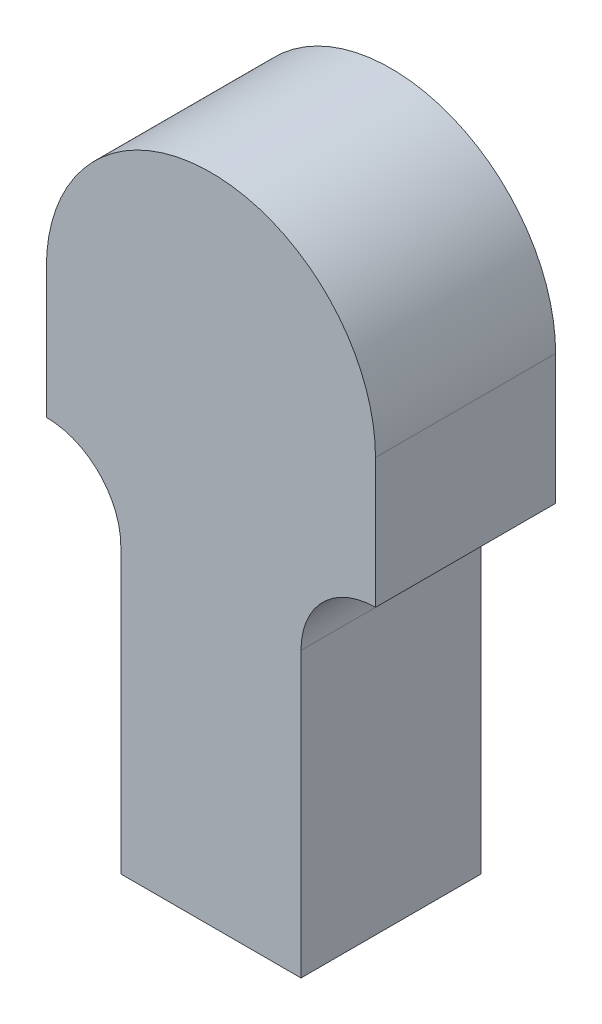
ISO-10303-21;
HEADER;
FILE_DESCRIPTION(('STEP AP214'),'2;1');
FILE_NAME('part.step','',(''),(''),'','','');
FILE_SCHEMA(('AUTOMOTIVE_DESIGN { 1 0 10303 214 1 1 1 1 }'));
ENDSEC;
DATA;
#1=APPLICATION_CONTEXT('core data for automotive mechanical design processes');
#2=APPLICATION_PROTOCOL_DEFINITION('international standard','automotive_design',2000,#1);
#3=PRODUCT_CONTEXT('',#1,'mechanical');
#4=PRODUCT('Part','Part','',(#3));
#5=PRODUCT_RELATED_PRODUCT_CATEGORY('part','',(#4));
#6=PRODUCT_DEFINITION_FORMATION('','',#4);
#7=PRODUCT_DEFINITION_CONTEXT('part definition',#1,'design');
#8=PRODUCT_DEFINITION('design','',#6,#7);
#9=PRODUCT_DEFINITION_SHAPE('','',#8);
#10=(LENGTH_UNIT() NAMED_UNIT(*) SI_UNIT(.MILLI.,.METRE.));
#11=(NAMED_UNIT(*) PLANE_ANGLE_UNIT() SI_UNIT($,.RADIAN.));
#12=(NAMED_UNIT(*) SI_UNIT($,.STERADIAN.) SOLID_ANGLE_UNIT());
#13=UNCERTAINTY_MEASURE_WITH_UNIT(LENGTH_MEASURE(1.E-05),#10,'distance_accuracy_value','');
#14=(GEOMETRIC_REPRESENTATION_CONTEXT(3) GLOBAL_UNCERTAINTY_ASSIGNED_CONTEXT((#13)) GLOBAL_UNIT_ASSIGNED_CONTEXT((#10,
#11,#12)) REPRESENTATION_CONTEXT('',''));
#15=CARTESIAN_POINT('',(0.,0.,0.));
#16=DIRECTION('',(0.,0.,1.));
#17=DIRECTION('',(1.,0.,0.));
#18=AXIS2_PLACEMENT_3D('',#15,#16,#17);
#19=CARTESIAN_POINT('',(7.9375,-18.,15.875));
#20=DIRECTION('',(-1.,0.,0.));
#21=DIRECTION('',(0.,-1.,0.));
#22=AXIS2_PLACEMENT_3D('',#19,#20,#21);
#23=PLANE('',#22);
#24=DIRECTION('',(0.,1.,0.));
#25=VECTOR('',#24,1.);
#26=CARTESIAN_POINT('',(7.9375,-18.,0.));
#27=LINE('',#26,#25);
#28=CARTESIAN_POINT('',(7.9375,-43.,0.));
#29=VERTEX_POINT('',#28);
#30=CARTESIAN_POINT('',(7.9375,-18.,0.));
#31=VERTEX_POINT('',#30);
#32=EDGE_CURVE('E131',#29,#31,#27,.T.);
#33=ORIENTED_EDGE('',*,*,#32,.T.);
#34=DIRECTION('',(0.,0.,-1.));
#35=VECTOR('',#34,1.);
#36=CARTESIAN_POINT('',(7.9375,-18.,15.875));
#37=LINE('',#36,#35);
#38=CARTESIAN_POINT('',(7.9375,-18.,15.875));
#39=VERTEX_POINT('',#38);
#40=EDGE_CURVE('E11',#39,#31,#37,.T.);
#41=ORIENTED_EDGE('',*,*,#40,.F.);
#42=DIRECTION('',(0.,1.,0.));
#43=VECTOR('',#42,1.);
#44=CARTESIAN_POINT('',(7.9375,-18.,15.875));
#45=LINE('',#44,#43);
#46=CARTESIAN_POINT('',(7.9375,-43.,15.875));
#47=VERTEX_POINT('',#46);
#48=EDGE_CURVE('E145',#47,#39,#45,.T.);
#49=ORIENTED_EDGE('',*,*,#48,.F.);
#50=DIRECTION('',(0.,0.,-1.));
#51=VECTOR('',#50,1.);
#52=CARTESIAN_POINT('',(7.9375,-43.,15.875));
#53=LINE('',#52,#51);
#54=EDGE_CURVE('E127',#47,#29,#53,.T.);
#55=ORIENTED_EDGE('',*,*,#54,.T.);
#56=EDGE_LOOP('',(#33,#41,#49,#55));
#57=FACE_BOUND('',#56,.T.);
#58=ADVANCED_FACE('F35',(#57),#23,.F.);
#59=CARTESIAN_POINT('',(14.5,-18.,15.875));
#60=DIRECTION('',(0.,0.,-1.));
#61=DIRECTION('',(-1.,0.,0.));
#62=AXIS2_PLACEMENT_3D('',#59,#60,#61);
#63=CYLINDRICAL_SURFACE('',#62,6.5625);
#64=CARTESIAN_POINT('',(14.5,-18.,0.));
#65=DIRECTION('',(0.,0.,-1.));
#66=DIRECTION('',(1.,0.,0.));
#67=AXIS2_PLACEMENT_3D('',#64,#65,#66);
#68=CIRCLE('',#67,6.5625);
#69=CARTESIAN_POINT('',(14.5,-11.4375,0.));
#70=VERTEX_POINT('',#69);
#71=EDGE_CURVE('E134',#31,#70,#68,.T.);
#72=ORIENTED_EDGE('',*,*,#71,.T.);
#73=DIRECTION('',(0.,0.,-1.));
#74=VECTOR('',#73,1.);
#75=CARTESIAN_POINT('',(14.5,-11.4375,15.875));
#76=LINE('',#75,#74);
#77=CARTESIAN_POINT('',(14.5,-11.4375,15.875));
#78=VERTEX_POINT('',#77);
#79=EDGE_CURVE('E43',#78,#70,#76,.T.);
#80=ORIENTED_EDGE('',*,*,#79,.F.);
#81=CARTESIAN_POINT('',(14.5,-18.,15.875));
#82=DIRECTION('',(0.,0.,-1.));
#83=DIRECTION('',(1.,0.,0.));
#84=AXIS2_PLACEMENT_3D('',#81,#82,#83);
#85=CIRCLE('',#84,6.5625);
#86=EDGE_CURVE('E94',#39,#78,#85,.T.);
#87=ORIENTED_EDGE('',*,*,#86,.F.);
#88=ORIENTED_EDGE('',*,*,#40,.T.);
#89=EDGE_LOOP('',(#72,#80,#87,#88));
#90=FACE_BOUND('',#89,.T.);
#91=ADVANCED_FACE('F180',(#90),#63,.F.);
#92=CARTESIAN_POINT('',(14.5,0.,15.875));
#93=DIRECTION('',(-1.,0.,0.));
#94=DIRECTION('',(0.,0.,1.));
#95=AXIS2_PLACEMENT_3D('',#92,#93,#94);
#96=PLANE('',#95);
#97=DIRECTION('',(0.,1.,0.));
#98=VECTOR('',#97,1.);
#99=CARTESIAN_POINT('',(14.5,0.,0.));
#100=LINE('',#99,#98);
#101=CARTESIAN_POINT('',(14.5,0.,0.));
#102=VERTEX_POINT('',#101);
#103=EDGE_CURVE('E136',#70,#102,#100,.T.);
#104=ORIENTED_EDGE('',*,*,#103,.T.);
#105=DIRECTION('',(0.,0.,-1.));
#106=VECTOR('',#105,1.);
#107=CARTESIAN_POINT('',(14.5,0.,15.875));
#108=LINE('',#107,#106);
#109=CARTESIAN_POINT('',(14.5,0.,15.875));
#110=VERTEX_POINT('',#109);
#111=EDGE_CURVE('E152',#110,#102,#108,.T.);
#112=ORIENTED_EDGE('',*,*,#111,.F.);
#113=DIRECTION('',(0.,1.,0.));
#114=VECTOR('',#113,1.);
#115=CARTESIAN_POINT('',(14.5,0.,15.875));
#116=LINE('',#115,#114);
#117=EDGE_CURVE('E160',#78,#110,#116,.T.);
#118=ORIENTED_EDGE('',*,*,#117,.F.);
#119=ORIENTED_EDGE('',*,*,#79,.T.);
#120=EDGE_LOOP('',(#104,#112,#118,#119));
#121=FACE_BOUND('',#120,.T.);
#122=ADVANCED_FACE('F158',(#121),#96,.F.);
#123=CARTESIAN_POINT('',(0.,0.,15.875));
#124=DIRECTION('',(0.,0.,-1.));
#125=DIRECTION('',(-1.,0.,0.));
#126=AXIS2_PLACEMENT_3D('',#123,#124,#125);
#127=CYLINDRICAL_SURFACE('',#126,14.5);
#128=CARTESIAN_POINT('',(0.,0.,0.));
#129=DIRECTION('',(0.,0.,1.));
#130=DIRECTION('',(1.,0.,0.));
#131=AXIS2_PLACEMENT_3D('',#128,#129,#130);
#132=CIRCLE('',#131,14.5);
#133=CARTESIAN_POINT('',(-14.5,0.,0.));
#134=VERTEX_POINT('',#133);
#135=EDGE_CURVE('E138',#102,#134,#132,.T.);
#136=ORIENTED_EDGE('',*,*,#135,.T.);
#137=DIRECTION('',(0.,0.,-1.));
#138=VECTOR('',#137,1.);
#139=CARTESIAN_POINT('',(-14.5,0.,15.875));
#140=LINE('',#139,#138);
#141=CARTESIAN_POINT('',(-14.5,0.,15.875));
#142=VERTEX_POINT('',#141);
#143=EDGE_CURVE('E149',#142,#134,#140,.T.);
#144=ORIENTED_EDGE('',*,*,#143,.F.);
#145=CARTESIAN_POINT('',(0.,0.,15.875));
#146=DIRECTION('',(0.,0.,1.));
#147=DIRECTION('',(1.,0.,0.));
#148=AXIS2_PLACEMENT_3D('',#145,#146,#147);
#149=CIRCLE('',#148,14.5);
#150=EDGE_CURVE('E172',#110,#142,#149,.T.);
#151=ORIENTED_EDGE('',*,*,#150,.F.);
#152=ORIENTED_EDGE('',*,*,#111,.T.);
#153=EDGE_LOOP('',(#136,#144,#151,#152));
#154=FACE_BOUND('',#153,.T.);
#155=ADVANCED_FACE('F168',(#154),#127,.T.);
#156=CARTESIAN_POINT('',(-14.5,0.,15.875));
#157=DIRECTION('',(1.,0.,0.));
#158=DIRECTION('',(0.,0.,-1.));
#159=AXIS2_PLACEMENT_3D('',#156,#157,#158);
#160=PLANE('',#159);
#161=DIRECTION('',(0.,-1.,0.));
#162=VECTOR('',#161,1.);
#163=CARTESIAN_POINT('',(-14.5,0.,0.));
#164=LINE('',#163,#162);
#165=CARTESIAN_POINT('',(-14.5,-11.4375,0.));
#166=VERTEX_POINT('',#165);
#167=EDGE_CURVE('E140',#134,#166,#164,.T.);
#168=ORIENTED_EDGE('',*,*,#167,.T.);
#169=DIRECTION('',(0.,0.,-1.));
#170=VECTOR('',#169,1.);
#171=CARTESIAN_POINT('',(-14.5,-11.4375,15.875));
#172=LINE('',#171,#170);
#173=CARTESIAN_POINT('',(-14.5,-11.4375,15.875));
#174=VERTEX_POINT('',#173);
#175=EDGE_CURVE('E122',#174,#166,#172,.T.);
#176=ORIENTED_EDGE('',*,*,#175,.F.);
#177=DIRECTION('',(0.,-1.,0.));
#178=VECTOR('',#177,1.);
#179=CARTESIAN_POINT('',(-14.5,0.,15.875));
#180=LINE('',#179,#178);
#181=EDGE_CURVE('E113',#142,#174,#180,.T.);
#182=ORIENTED_EDGE('',*,*,#181,.F.);
#183=ORIENTED_EDGE('',*,*,#143,.T.);
#184=EDGE_LOOP('',(#168,#176,#182,#183));
#185=FACE_BOUND('',#184,.T.);
#186=ADVANCED_FACE('F171',(#185),#160,.F.);
#187=CARTESIAN_POINT('',(-14.5,-18.,15.875));
#188=DIRECTION('',(0.,0.,-1.));
#189=DIRECTION('',(-1.,0.,0.));
#190=AXIS2_PLACEMENT_3D('',#187,#188,#189);
#191=CYLINDRICAL_SURFACE('',#190,6.5625);
#192=CARTESIAN_POINT('',(-14.5,-18.,0.));
#193=DIRECTION('',(0.,0.,-1.));
#194=DIRECTION('',(1.,0.,0.));
#195=AXIS2_PLACEMENT_3D('',#192,#193,#194);
#196=CIRCLE('',#195,6.5625);
#197=CARTESIAN_POINT('',(-7.9375,-18.,0.));
#198=VERTEX_POINT('',#197);
#199=EDGE_CURVE('E121',#166,#198,#196,.T.);
#200=ORIENTED_EDGE('',*,*,#199,.T.);
#201=DIRECTION('',(0.,0.,-1.));
#202=VECTOR('',#201,1.);
#203=CARTESIAN_POINT('',(-7.9375,-18.,15.875));
#204=LINE('',#203,#202);
#205=CARTESIAN_POINT('',(-7.9375,-18.,15.875));
#206=VERTEX_POINT('',#205);
#207=EDGE_CURVE('E118',#206,#198,#204,.T.);
#208=ORIENTED_EDGE('',*,*,#207,.F.);
#209=CARTESIAN_POINT('',(-14.5,-18.,15.875));
#210=DIRECTION('',(0.,0.,-1.));
#211=DIRECTION('',(1.,0.,0.));
#212=AXIS2_PLACEMENT_3D('',#209,#210,#211);
#213=CIRCLE('',#212,6.5625);
#214=EDGE_CURVE('E107',#174,#206,#213,.T.);
#215=ORIENTED_EDGE('',*,*,#214,.F.);
#216=ORIENTED_EDGE('',*,*,#175,.T.);
#217=EDGE_LOOP('',(#200,#208,#215,#216));
#218=FACE_BOUND('',#217,.T.);
#219=ADVANCED_FACE('F119',(#218),#191,.F.);
#220=CARTESIAN_POINT('',(-7.9375,-18.,15.875));
#221=DIRECTION('',(1.,0.,0.));
#222=DIRECTION('',(0.,1.,0.));
#223=AXIS2_PLACEMENT_3D('',#220,#221,#222);
#224=PLANE('',#223);
#225=DIRECTION('',(0.,-1.,0.));
#226=VECTOR('',#225,1.);
#227=CARTESIAN_POINT('',(-7.9375,-18.,0.));
#228=LINE('',#227,#226);
#229=CARTESIAN_POINT('',(-7.9375,-43.,0.));
#230=VERTEX_POINT('',#229);
#231=EDGE_CURVE('E80',#198,#230,#228,.T.);
#232=ORIENTED_EDGE('',*,*,#231,.T.);
#233=DIRECTION('',(0.,0.,-1.));
#234=VECTOR('',#233,1.);
#235=CARTESIAN_POINT('',(-7.9375,-43.,15.875));
#236=LINE('',#235,#234);
#237=CARTESIAN_POINT('',(-7.9375,-43.,15.875));
#238=VERTEX_POINT('',#237);
#239=EDGE_CURVE('E123',#238,#230,#236,.T.);
#240=ORIENTED_EDGE('',*,*,#239,.F.);
#241=DIRECTION('',(0.,-1.,0.));
#242=VECTOR('',#241,1.);
#243=CARTESIAN_POINT('',(-7.9375,-18.,15.875));
#244=LINE('',#243,#242);
#245=EDGE_CURVE('E111',#206,#238,#244,.T.);
#246=ORIENTED_EDGE('',*,*,#245,.F.);
#247=ORIENTED_EDGE('',*,*,#207,.T.);
#248=EDGE_LOOP('',(#232,#240,#246,#247));
#249=FACE_BOUND('',#248,.T.);
#250=ADVANCED_FACE('F125',(#249),#224,.F.);
#251=CARTESIAN_POINT('',(-7.9375,-43.,15.875));
#252=DIRECTION('',(0.,1.,0.));
#253=DIRECTION('',(0.,0.,1.));
#254=AXIS2_PLACEMENT_3D('',#251,#252,#253);
#255=PLANE('',#254);
#256=DIRECTION('',(1.,0.,0.));
#257=VECTOR('',#256,1.);
#258=CARTESIAN_POINT('',(-7.9375,-43.,0.));
#259=LINE('',#258,#257);
#260=EDGE_CURVE('E86',#230,#29,#259,.T.);
#261=ORIENTED_EDGE('',*,*,#260,.T.);
#262=ORIENTED_EDGE('',*,*,#54,.F.);
#263=DIRECTION('',(1.,0.,0.));
#264=VECTOR('',#263,1.);
#265=CARTESIAN_POINT('',(-7.9375,-43.,15.875));
#266=LINE('',#265,#264);
#267=EDGE_CURVE('E51',#238,#47,#266,.T.);
#268=ORIENTED_EDGE('',*,*,#267,.F.);
#269=ORIENTED_EDGE('',*,*,#239,.T.);
#270=EDGE_LOOP('',(#261,#262,#268,#269));
#271=FACE_BOUND('',#270,.T.);
#272=ADVANCED_FACE('F196',(#271),#255,.F.);
#273=CARTESIAN_POINT('',(-14.5,-18.,15.875));
#274=DIRECTION('',(0.,0.,1.));
#275=DIRECTION('',(1.,0.,0.));
#276=AXIS2_PLACEMENT_3D('',#273,#274,#275);
#277=PLANE('',#276);
#278=ORIENTED_EDGE('',*,*,#48,.T.);
#279=ORIENTED_EDGE('',*,*,#86,.T.);
#280=ORIENTED_EDGE('',*,*,#117,.T.);
#281=ORIENTED_EDGE('',*,*,#150,.T.);
#282=ORIENTED_EDGE('',*,*,#181,.T.);
#283=ORIENTED_EDGE('',*,*,#214,.T.);
#284=ORIENTED_EDGE('',*,*,#245,.T.);
#285=ORIENTED_EDGE('',*,*,#267,.T.);
#286=EDGE_LOOP('',(#278,#279,#280,#281,#282,#283,#284,#285));
#287=FACE_BOUND('',#286,.T.);
#288=ADVANCED_FACE('F109',(#287),#277,.T.);
#289=CARTESIAN_POINT('',(-14.5,-18.,0.));
#290=DIRECTION('',(0.,0.,1.));
#291=DIRECTION('',(1.,0.,0.));
#292=AXIS2_PLACEMENT_3D('',#289,#290,#291);
#293=PLANE('',#292);
#294=ORIENTED_EDGE('',*,*,#32,.F.);
#295=ORIENTED_EDGE('',*,*,#260,.F.);
#296=ORIENTED_EDGE('',*,*,#231,.F.);
#297=ORIENTED_EDGE('',*,*,#199,.F.);
#298=ORIENTED_EDGE('',*,*,#167,.F.);
#299=ORIENTED_EDGE('',*,*,#135,.F.);
#300=ORIENTED_EDGE('',*,*,#103,.F.);
#301=ORIENTED_EDGE('',*,*,#71,.F.);
#302=EDGE_LOOP('',(#294,#295,#296,#297,#298,#299,#300,#301));
#303=FACE_BOUND('',#302,.T.);
#304=ADVANCED_FACE('F164',(#303),#293,.F.);
#305=CLOSED_SHELL('',(#58,#91,#122,#155,#186,#219,#250,#272,#288,#304));
#306=MANIFOLD_SOLID_BREP('B2',#305);
#307=ADVANCED_BREP_SHAPE_REPRESENTATION('',(#18,#306),#14);
#308=SHAPE_DEFINITION_REPRESENTATION(#9,#307);
ENDSEC;
END-ISO-10303-21;
